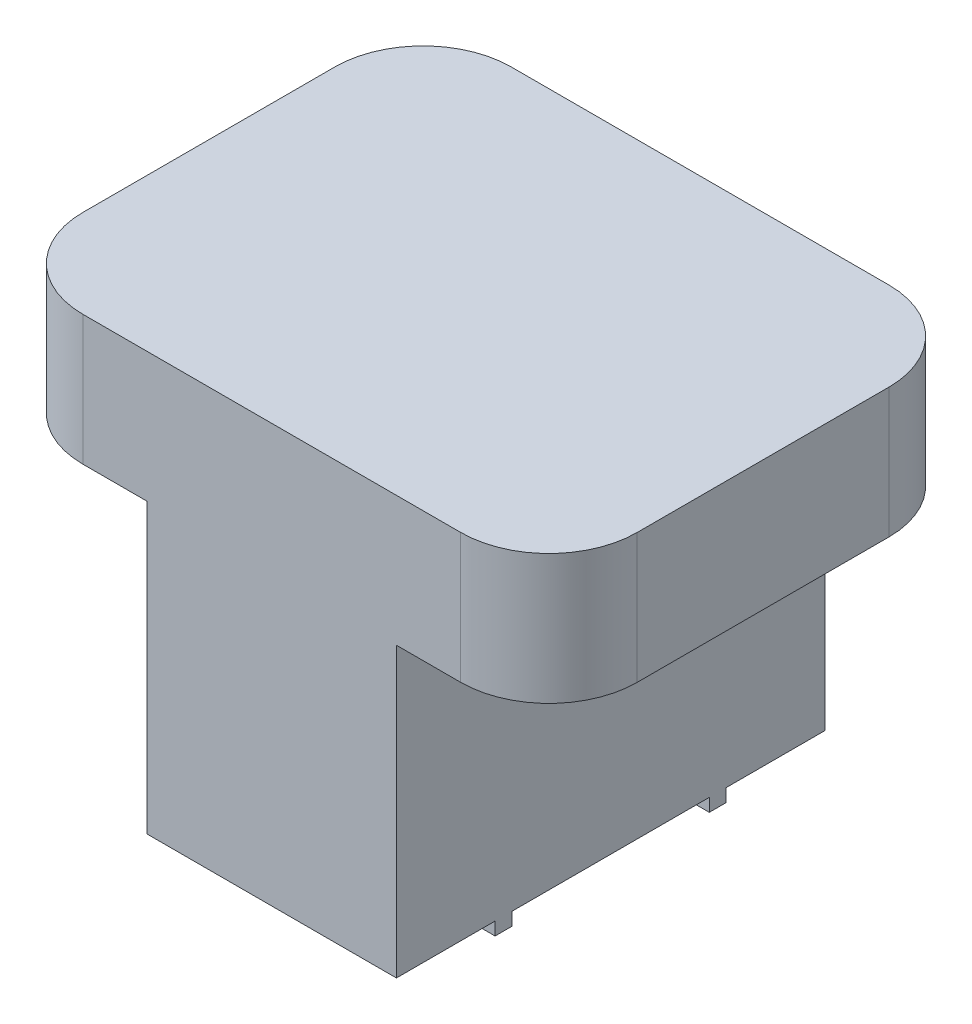
ISO-10303-21;
HEADER;
FILE_DESCRIPTION(('STEP AP214'),'2;1');
FILE_NAME('part.step','',(''),(''),'','','');
FILE_SCHEMA(('AUTOMOTIVE_DESIGN { 1 0 10303 214 1 1 1 1 }'));
ENDSEC;
DATA;
#1=APPLICATION_CONTEXT('core data for automotive mechanical design processes');
#2=APPLICATION_PROTOCOL_DEFINITION('international standard','automotive_design',2000,#1);
#3=PRODUCT_CONTEXT('',#1,'mechanical');
#4=PRODUCT('Part','Part','',(#3));
#5=PRODUCT_RELATED_PRODUCT_CATEGORY('part','',(#4));
#6=PRODUCT_DEFINITION_FORMATION('','',#4);
#7=PRODUCT_DEFINITION_CONTEXT('part definition',#1,'design');
#8=PRODUCT_DEFINITION('design','',#6,#7);
#9=PRODUCT_DEFINITION_SHAPE('','',#8);
#10=(LENGTH_UNIT() NAMED_UNIT(*) SI_UNIT(.MILLI.,.METRE.));
#11=(NAMED_UNIT(*) PLANE_ANGLE_UNIT() SI_UNIT($,.RADIAN.));
#12=(NAMED_UNIT(*) SI_UNIT($,.STERADIAN.) SOLID_ANGLE_UNIT());
#13=UNCERTAINTY_MEASURE_WITH_UNIT(LENGTH_MEASURE(1.E-05),#10,'distance_accuracy_value','');
#14=(GEOMETRIC_REPRESENTATION_CONTEXT(3) GLOBAL_UNCERTAINTY_ASSIGNED_CONTEXT((#13)) GLOBAL_UNIT_ASSIGNED_CONTEXT((#10,
#11,#12)) REPRESENTATION_CONTEXT('',''));
#15=CARTESIAN_POINT('',(0.,0.,0.));
#16=DIRECTION('',(0.,0.,1.));
#17=DIRECTION('',(1.,0.,0.));
#18=AXIS2_PLACEMENT_3D('',#15,#16,#17);
#19=CARTESIAN_POINT('',(18.4785,-20.447,-12.319));
#20=DIRECTION('',(0.,1.,0.));
#21=DIRECTION('',(0.,0.,1.));
#22=AXIS2_PLACEMENT_3D('',#19,#20,#21);
#23=PLANE('',#22);
#24=DIRECTION('',(-1.,0.,0.));
#25=VECTOR('',#24,1.);
#26=CARTESIAN_POINT('',(-6.70560000000001,-20.447,-9.652));
#27=LINE('',#26,#25);
#28=CARTESIAN_POINT('',(-6.70560000000001,-20.447,-9.652));
#29=VERTEX_POINT('',#28);
#30=CARTESIAN_POINT('',(-12.192,-20.447,-9.652));
#31=VERTEX_POINT('',#30);
#32=EDGE_CURVE('E57',#29,#31,#27,.T.);
#33=ORIENTED_EDGE('',*,*,#32,.F.);
#34=DIRECTION('',(0.,0.,-1.));
#35=VECTOR('',#34,1.);
#36=CARTESIAN_POINT('',(-6.70560000000001,-20.447,-9.652));
#37=LINE('',#36,#35);
#38=CARTESIAN_POINT('',(-6.70560000000001,-20.447,-11.303));
#39=VERTEX_POINT('',#38);
#40=EDGE_CURVE('E282',#29,#39,#37,.T.);
#41=ORIENTED_EDGE('',*,*,#40,.T.);
#42=DIRECTION('',(1.,0.,0.));
#43=VECTOR('',#42,1.);
#44=CARTESIAN_POINT('',(-12.192,-20.447,-11.303));
#45=LINE('',#44,#43);
#46=CARTESIAN_POINT('',(-12.192,-20.447,-11.303));
#47=VERTEX_POINT('',#46);
#48=EDGE_CURVE('E293',#47,#39,#45,.T.);
#49=ORIENTED_EDGE('',*,*,#48,.F.);
#50=DIRECTION('',(0.,0.,1.));
#51=VECTOR('',#50,1.);
#52=CARTESIAN_POINT('',(-12.192,-20.447,-20.955));
#53=LINE('',#52,#51);
#54=CARTESIAN_POINT('',(-12.192,-20.447,-20.955));
#55=VERTEX_POINT('',#54);
#56=EDGE_CURVE('E447',#55,#47,#53,.T.);
#57=ORIENTED_EDGE('',*,*,#56,.F.);
#58=DIRECTION('',(1.,0.,0.));
#59=VECTOR('',#58,1.);
#60=CARTESIAN_POINT('',(-18.4785,-20.447,-20.955));
#61=LINE('',#60,#59);
#62=CARTESIAN_POINT('',(12.192,-20.447,-20.955));
#63=VERTEX_POINT('',#62);
#64=EDGE_CURVE('E509',#55,#63,#61,.T.);
#65=ORIENTED_EDGE('',*,*,#64,.T.);
#66=DIRECTION('',(0.,0.,-1.));
#67=VECTOR('',#66,1.);
#68=CARTESIAN_POINT('',(12.192,-20.447,20.955));
#69=LINE('',#68,#67);
#70=CARTESIAN_POINT('',(12.192,-20.447,-11.303));
#71=VERTEX_POINT('',#70);
#72=EDGE_CURVE('E478',#71,#63,#69,.T.);
#73=ORIENTED_EDGE('',*,*,#72,.F.);
#74=DIRECTION('',(1.,0.,0.));
#75=VECTOR('',#74,1.);
#76=CARTESIAN_POINT('',(6.7056,-20.447,-11.303));
#77=LINE('',#76,#75);
#78=CARTESIAN_POINT('',(6.7056,-20.447,-11.303));
#79=VERTEX_POINT('',#78);
#80=EDGE_CURVE('E405',#79,#71,#77,.T.);
#81=ORIENTED_EDGE('',*,*,#80,.F.);
#82=DIRECTION('',(0.,0.,1.));
#83=VECTOR('',#82,1.);
#84=CARTESIAN_POINT('',(6.7056,-20.447,-11.303));
#85=LINE('',#84,#83);
#86=CARTESIAN_POINT('',(6.7056,-20.447,-9.652));
#87=VERTEX_POINT('',#86);
#88=EDGE_CURVE('E411',#79,#87,#85,.T.);
#89=ORIENTED_EDGE('',*,*,#88,.T.);
#90=DIRECTION('',(-1.,0.,0.));
#91=VECTOR('',#90,1.);
#92=CARTESIAN_POINT('',(12.192,-20.447,-9.652));
#93=LINE('',#92,#91);
#94=CARTESIAN_POINT('',(12.192,-20.447,-9.652));
#95=VERTEX_POINT('',#94);
#96=EDGE_CURVE('E406',#95,#87,#93,.T.);
#97=ORIENTED_EDGE('',*,*,#96,.F.);
#98=CARTESIAN_POINT('',(12.192,-20.447,9.652));
#99=VERTEX_POINT('',#98);
#100=EDGE_CURVE('E484',#99,#95,#69,.T.);
#101=ORIENTED_EDGE('',*,*,#100,.F.);
#102=DIRECTION('',(1.,0.,0.));
#103=VECTOR('',#102,1.);
#104=CARTESIAN_POINT('',(6.7056,-20.447,9.652));
#105=LINE('',#104,#103);
#106=CARTESIAN_POINT('',(6.7056,-20.447,9.652));
#107=VERTEX_POINT('',#106);
#108=EDGE_CURVE('E365',#107,#99,#105,.T.);
#109=ORIENTED_EDGE('',*,*,#108,.F.);
#110=DIRECTION('',(0.,0.,1.));
#111=VECTOR('',#110,1.);
#112=CARTESIAN_POINT('',(6.7056,-20.447,9.652));
#113=LINE('',#112,#111);
#114=CARTESIAN_POINT('',(6.7056,-20.447,11.303));
#115=VERTEX_POINT('',#114);
#116=EDGE_CURVE('E371',#107,#115,#113,.T.);
#117=ORIENTED_EDGE('',*,*,#116,.T.);
#118=DIRECTION('',(-1.,0.,0.));
#119=VECTOR('',#118,1.);
#120=CARTESIAN_POINT('',(12.192,-20.447,11.303));
#121=LINE('',#120,#119);
#122=CARTESIAN_POINT('',(12.192,-20.447,11.303));
#123=VERTEX_POINT('',#122);
#124=EDGE_CURVE('E366',#123,#115,#121,.T.);
#125=ORIENTED_EDGE('',*,*,#124,.F.);
#126=CARTESIAN_POINT('',(12.192,-20.447,20.955));
#127=VERTEX_POINT('',#126);
#128=EDGE_CURVE('E479',#127,#123,#69,.T.);
#129=ORIENTED_EDGE('',*,*,#128,.F.);
#130=DIRECTION('',(-1.,0.,0.));
#131=VECTOR('',#130,1.);
#132=CARTESIAN_POINT('',(18.4785,-20.447,20.955));
#133=LINE('',#132,#131);
#134=CARTESIAN_POINT('',(-12.192,-20.447,20.955));
#135=VERTEX_POINT('',#134);
#136=EDGE_CURVE('E510',#127,#135,#133,.T.);
#137=ORIENTED_EDGE('',*,*,#136,.T.);
#138=CARTESIAN_POINT('',(-12.192,-20.447,11.303));
#139=VERTEX_POINT('',#138);
#140=EDGE_CURVE('E446',#139,#135,#53,.T.);
#141=ORIENTED_EDGE('',*,*,#140,.F.);
#142=DIRECTION('',(-1.,0.,0.));
#143=VECTOR('',#142,1.);
#144=CARTESIAN_POINT('',(-6.7056,-20.447,11.303));
#145=LINE('',#144,#143);
#146=CARTESIAN_POINT('',(-6.7056,-20.447,11.303));
#147=VERTEX_POINT('',#146);
#148=EDGE_CURVE('E68',#147,#139,#145,.T.);
#149=ORIENTED_EDGE('',*,*,#148,.F.);
#150=DIRECTION('',(0.,0.,-1.));
#151=VECTOR('',#150,1.);
#152=CARTESIAN_POINT('',(-6.7056,-20.447,11.303));
#153=LINE('',#152,#151);
#154=CARTESIAN_POINT('',(-6.7056,-20.447,9.652));
#155=VERTEX_POINT('',#154);
#156=EDGE_CURVE('E326',#147,#155,#153,.T.);
#157=ORIENTED_EDGE('',*,*,#156,.T.);
#158=DIRECTION('',(1.,0.,0.));
#159=VECTOR('',#158,1.);
#160=CARTESIAN_POINT('',(-12.192,-20.447,9.652));
#161=LINE('',#160,#159);
#162=CARTESIAN_POINT('',(-12.192,-20.447,9.652));
#163=VERTEX_POINT('',#162);
#164=EDGE_CURVE('E330',#163,#155,#161,.T.);
#165=ORIENTED_EDGE('',*,*,#164,.F.);
#166=EDGE_CURVE('E451',#31,#163,#53,.T.);
#167=ORIENTED_EDGE('',*,*,#166,.F.);
#168=EDGE_LOOP('',(#33,#41,#49,#57,#65,#73,#81,#89,#97,#101,#109,#117,#125,#129,#137,#141,#149,
#157,#165,#167));
#169=FACE_BOUND('',#168,.T.);
#170=ADVANCED_FACE('F38',(#169),#23,.F.);
#171=CARTESIAN_POINT('',(18.4785,20.447,-12.319));
#172=DIRECTION('',(0.,-1.,0.));
#173=DIRECTION('',(0.,0.,-1.));
#174=AXIS2_PLACEMENT_3D('',#171,#172,#173);
#175=CYLINDRICAL_SURFACE('',#174,8.636);
#176=DIRECTION('',(0.,-1.,0.));
#177=VECTOR('',#176,1.);
#178=CARTESIAN_POINT('',(27.1145,20.447,-12.319));
#179=LINE('',#178,#177);
#180=CARTESIAN_POINT('',(27.1145,20.447,-12.319));
#181=VERTEX_POINT('',#180);
#182=CARTESIAN_POINT('',(27.1145,7.747,-12.319));
#183=VERTEX_POINT('',#182);
#184=EDGE_CURVE('E522',#181,#183,#179,.T.);
#185=ORIENTED_EDGE('',*,*,#184,.T.);
#186=CARTESIAN_POINT('',(18.4785,7.747,-12.319));
#187=DIRECTION('',(0.,1.,0.));
#188=DIRECTION('',(0.,0.,1.));
#189=AXIS2_PLACEMENT_3D('',#186,#187,#188);
#190=CIRCLE('',#189,8.636);
#191=CARTESIAN_POINT('',(18.4785,7.747,-20.955));
#192=VERTEX_POINT('',#191);
#193=EDGE_CURVE('E500',#192,#183,#190,.F.);
#194=ORIENTED_EDGE('',*,*,#193,.F.);
#195=DIRECTION('',(0.,-1.,0.));
#196=VECTOR('',#195,1.);
#197=CARTESIAN_POINT('',(18.4785,20.447,-20.955));
#198=LINE('',#197,#196);
#199=CARTESIAN_POINT('',(18.4785,20.447,-20.955));
#200=VERTEX_POINT('',#199);
#201=EDGE_CURVE('E11',#200,#192,#198,.T.);
#202=ORIENTED_EDGE('',*,*,#201,.F.);
#203=CARTESIAN_POINT('',(18.4785,20.447,-12.319));
#204=DIRECTION('',(0.,1.,0.));
#205=DIRECTION('',(0.,0.,1.));
#206=AXIS2_PLACEMENT_3D('',#203,#204,#205);
#207=CIRCLE('',#206,8.636);
#208=EDGE_CURVE('E514',#181,#200,#207,.T.);
#209=ORIENTED_EDGE('',*,*,#208,.F.);
#210=EDGE_LOOP('',(#185,#194,#202,#209));
#211=FACE_BOUND('',#210,.T.);
#212=ADVANCED_FACE('F589',(#211),#175,.T.);
#213=CARTESIAN_POINT('',(-18.4785,20.447,-20.955));
#214=DIRECTION('',(0.,0.,-1.));
#215=DIRECTION('',(-1.,0.,0.));
#216=AXIS2_PLACEMENT_3D('',#213,#214,#215);
#217=PLANE('',#216);
#218=DIRECTION('',(1.,0.,0.));
#219=VECTOR('',#218,1.);
#220=CARTESIAN_POINT('',(-18.4785,7.747,-20.955));
#221=LINE('',#220,#219);
#222=CARTESIAN_POINT('',(-18.4785,7.747,-20.955));
#223=VERTEX_POINT('',#222);
#224=CARTESIAN_POINT('',(-12.192,7.747,-20.955));
#225=VERTEX_POINT('',#224);
#226=EDGE_CURVE('E456',#223,#225,#221,.T.);
#227=ORIENTED_EDGE('',*,*,#226,.F.);
#228=DIRECTION('',(0.,-1.,0.));
#229=VECTOR('',#228,1.);
#230=CARTESIAN_POINT('',(-18.4785,20.447,-20.955));
#231=LINE('',#230,#229);
#232=CARTESIAN_POINT('',(-18.4785,20.447,-20.955));
#233=VERTEX_POINT('',#232);
#234=EDGE_CURVE('E47',#233,#223,#231,.T.);
#235=ORIENTED_EDGE('',*,*,#234,.F.);
#236=DIRECTION('',(1.,0.,0.));
#237=VECTOR('',#236,1.);
#238=CARTESIAN_POINT('',(-18.4785,20.447,-20.955));
#239=LINE('',#238,#237);
#240=EDGE_CURVE('E543',#233,#200,#239,.T.);
#241=ORIENTED_EDGE('',*,*,#240,.T.);
#242=ORIENTED_EDGE('',*,*,#201,.T.);
#243=DIRECTION('',(1.,0.,0.));
#244=VECTOR('',#243,1.);
#245=CARTESIAN_POINT('',(12.192,7.747,-20.955));
#246=LINE('',#245,#244);
#247=CARTESIAN_POINT('',(12.192,7.74700000000002,-20.955));
#248=VERTEX_POINT('',#247);
#249=EDGE_CURVE('E502',#248,#192,#246,.T.);
#250=ORIENTED_EDGE('',*,*,#249,.F.);
#251=DIRECTION('',(0.,-1.,0.));
#252=VECTOR('',#251,1.);
#253=CARTESIAN_POINT('',(12.192,64.9344039054877,-20.955));
#254=LINE('',#253,#252);
#255=EDGE_CURVE('E488',#248,#63,#254,.T.);
#256=ORIENTED_EDGE('',*,*,#255,.T.);
#257=ORIENTED_EDGE('',*,*,#64,.F.);
#258=DIRECTION('',(0.,-1.,0.));
#259=VECTOR('',#258,1.);
#260=CARTESIAN_POINT('',(-12.192,64.9344039054877,-20.955));
#261=LINE('',#260,#259);
#262=EDGE_CURVE('E460',#225,#55,#261,.T.);
#263=ORIENTED_EDGE('',*,*,#262,.F.);
#264=EDGE_LOOP('',(#227,#235,#241,#242,#250,#256,#257,#263));
#265=FACE_BOUND('',#264,.T.);
#266=ADVANCED_FACE('F40',(#265),#217,.T.);
#267=CARTESIAN_POINT('',(-18.4785,20.447,-12.319));
#268=DIRECTION('',(0.,-1.,0.));
#269=DIRECTION('',(0.,0.,-1.));
#270=AXIS2_PLACEMENT_3D('',#267,#268,#269);
#271=CYLINDRICAL_SURFACE('',#270,8.636);
#272=CARTESIAN_POINT('',(-18.4785,7.747,-12.319));
#273=DIRECTION('',(0.,1.,0.));
#274=DIRECTION('',(0.,0.,1.));
#275=AXIS2_PLACEMENT_3D('',#272,#273,#274);
#276=CIRCLE('',#275,8.636);
#277=CARTESIAN_POINT('',(-27.1145,7.747,-12.319));
#278=VERTEX_POINT('',#277);
#279=EDGE_CURVE('E461',#278,#223,#276,.F.);
#280=ORIENTED_EDGE('',*,*,#279,.F.);
#281=DIRECTION('',(0.,-1.,0.));
#282=VECTOR('',#281,1.);
#283=CARTESIAN_POINT('',(-27.1145,20.447,-12.319));
#284=LINE('',#283,#282);
#285=CARTESIAN_POINT('',(-27.1145,20.447,-12.319));
#286=VERTEX_POINT('',#285);
#287=EDGE_CURVE('E569',#286,#278,#284,.T.);
#288=ORIENTED_EDGE('',*,*,#287,.F.);
#289=CARTESIAN_POINT('',(-18.4785,20.447,-12.319));
#290=DIRECTION('',(0.,-1.,0.));
#291=DIRECTION('',(0.,0.,-1.));
#292=AXIS2_PLACEMENT_3D('',#289,#290,#291);
#293=CIRCLE('',#292,8.636);
#294=EDGE_CURVE('E539',#286,#233,#293,.T.);
#295=ORIENTED_EDGE('',*,*,#294,.T.);
#296=ORIENTED_EDGE('',*,*,#234,.T.);
#297=EDGE_LOOP('',(#280,#288,#295,#296));
#298=FACE_BOUND('',#297,.T.);
#299=ADVANCED_FACE('F576',(#298),#271,.T.);
#300=CARTESIAN_POINT('',(-27.1145,20.447,-12.319));
#301=DIRECTION('',(1.,0.,0.));
#302=DIRECTION('',(0.,0.,-1.));
#303=AXIS2_PLACEMENT_3D('',#300,#301,#302);
#304=PLANE('',#303);
#305=ORIENTED_EDGE('',*,*,#287,.T.);
#306=DIRECTION('',(0.,0.,-1.));
#307=VECTOR('',#306,1.);
#308=CARTESIAN_POINT('',(-27.1145,7.747,12.319));
#309=LINE('',#308,#307);
#310=CARTESIAN_POINT('',(-27.1145,7.747,12.319));
#311=VERTEX_POINT('',#310);
#312=EDGE_CURVE('E464',#311,#278,#309,.T.);
#313=ORIENTED_EDGE('',*,*,#312,.F.);
#314=DIRECTION('',(0.,-1.,0.));
#315=VECTOR('',#314,1.);
#316=CARTESIAN_POINT('',(-27.1145,20.447,12.319));
#317=LINE('',#316,#315);
#318=CARTESIAN_POINT('',(-27.1145,20.447,12.319));
#319=VERTEX_POINT('',#318);
#320=EDGE_CURVE('E565',#319,#311,#317,.T.);
#321=ORIENTED_EDGE('',*,*,#320,.F.);
#322=DIRECTION('',(0.,0.,1.));
#323=VECTOR('',#322,1.);
#324=CARTESIAN_POINT('',(-27.1145,20.447,-12.319));
#325=LINE('',#324,#323);
#326=EDGE_CURVE('E535',#286,#319,#325,.T.);
#327=ORIENTED_EDGE('',*,*,#326,.F.);
#328=EDGE_LOOP('',(#305,#313,#321,#327));
#329=FACE_BOUND('',#328,.T.);
#330=ADVANCED_FACE('F612',(#329),#304,.F.);
#331=CARTESIAN_POINT('',(-18.4785,20.447,12.319));
#332=DIRECTION('',(0.,-1.,0.));
#333=DIRECTION('',(0.,0.,-1.));
#334=AXIS2_PLACEMENT_3D('',#331,#332,#333);
#335=CYLINDRICAL_SURFACE('',#334,8.636);
#336=ORIENTED_EDGE('',*,*,#320,.T.);
#337=CARTESIAN_POINT('',(-18.4785,7.747,12.319));
#338=DIRECTION('',(0.,1.,0.));
#339=DIRECTION('',(0.,0.,1.));
#340=AXIS2_PLACEMENT_3D('',#337,#338,#339);
#341=CIRCLE('',#340,8.636);
#342=CARTESIAN_POINT('',(-18.4785,7.747,20.955));
#343=VERTEX_POINT('',#342);
#344=EDGE_CURVE('E467',#343,#311,#341,.F.);
#345=ORIENTED_EDGE('',*,*,#344,.F.);
#346=DIRECTION('',(0.,-1.,0.));
#347=VECTOR('',#346,1.);
#348=CARTESIAN_POINT('',(-18.4785,20.447,20.955));
#349=LINE('',#348,#347);
#350=CARTESIAN_POINT('',(-18.4785,20.447,20.955));
#351=VERTEX_POINT('',#350);
#352=EDGE_CURVE('E561',#351,#343,#349,.T.);
#353=ORIENTED_EDGE('',*,*,#352,.F.);
#354=CARTESIAN_POINT('',(-18.4785,20.447,12.319));
#355=DIRECTION('',(0.,1.,0.));
#356=DIRECTION('',(0.,0.,1.));
#357=AXIS2_PLACEMENT_3D('',#354,#355,#356);
#358=CIRCLE('',#357,8.636);
#359=EDGE_CURVE('E531',#319,#351,#358,.T.);
#360=ORIENTED_EDGE('',*,*,#359,.F.);
#361=EDGE_LOOP('',(#336,#345,#353,#360));
#362=FACE_BOUND('',#361,.T.);
#363=ADVANCED_FACE('F615',(#362),#335,.T.);
#364=CARTESIAN_POINT('',(18.4785,20.447,20.955));
#365=DIRECTION('',(0.,0.,1.));
#366=DIRECTION('',(1.,0.,0.));
#367=AXIS2_PLACEMENT_3D('',#364,#365,#366);
#368=PLANE('',#367);
#369=DIRECTION('',(-1.,0.,0.));
#370=VECTOR('',#369,1.);
#371=CARTESIAN_POINT('',(-12.192,7.747,20.955));
#372=LINE('',#371,#370);
#373=CARTESIAN_POINT('',(-12.192,7.74700000000002,20.955));
#374=VERTEX_POINT('',#373);
#375=EDGE_CURVE('E470',#374,#343,#372,.T.);
#376=ORIENTED_EDGE('',*,*,#375,.F.);
#377=DIRECTION('',(0.,-1.,0.));
#378=VECTOR('',#377,1.);
#379=CARTESIAN_POINT('',(-12.192,64.9344039054877,20.955));
#380=LINE('',#379,#378);
#381=EDGE_CURVE('E455',#374,#135,#380,.T.);
#382=ORIENTED_EDGE('',*,*,#381,.T.);
#383=ORIENTED_EDGE('',*,*,#136,.F.);
#384=DIRECTION('',(0.,-1.,0.));
#385=VECTOR('',#384,1.);
#386=CARTESIAN_POINT('',(12.192,64.9344039054877,20.955));
#387=LINE('',#386,#385);
#388=CARTESIAN_POINT('',(12.192,7.747,20.955));
#389=VERTEX_POINT('',#388);
#390=EDGE_CURVE('E493',#389,#127,#387,.T.);
#391=ORIENTED_EDGE('',*,*,#390,.F.);
#392=DIRECTION('',(-1.,0.,0.));
#393=VECTOR('',#392,1.);
#394=CARTESIAN_POINT('',(18.4785,7.747,20.955));
#395=LINE('',#394,#393);
#396=CARTESIAN_POINT('',(18.4785,7.747,20.955));
#397=VERTEX_POINT('',#396);
#398=EDGE_CURVE('E489',#397,#389,#395,.T.);
#399=ORIENTED_EDGE('',*,*,#398,.F.);
#400=DIRECTION('',(0.,-1.,0.));
#401=VECTOR('',#400,1.);
#402=CARTESIAN_POINT('',(18.4785,20.447,20.955));
#403=LINE('',#402,#401);
#404=CARTESIAN_POINT('',(18.4785,20.447,20.955));
#405=VERTEX_POINT('',#404);
#406=EDGE_CURVE('E557',#405,#397,#403,.T.);
#407=ORIENTED_EDGE('',*,*,#406,.F.);
#408=DIRECTION('',(-1.,0.,0.));
#409=VECTOR('',#408,1.);
#410=CARTESIAN_POINT('',(18.4785,20.447,20.955));
#411=LINE('',#410,#409);
#412=EDGE_CURVE('E527',#405,#351,#411,.T.);
#413=ORIENTED_EDGE('',*,*,#412,.T.);
#414=ORIENTED_EDGE('',*,*,#352,.T.);
#415=EDGE_LOOP('',(#376,#382,#383,#391,#399,#407,#413,#414));
#416=FACE_BOUND('',#415,.T.);
#417=ADVANCED_FACE('F618',(#416),#368,.T.);
#418=CARTESIAN_POINT('',(18.4785,20.447,12.319));
#419=DIRECTION('',(0.,-1.,0.));
#420=DIRECTION('',(0.,0.,-1.));
#421=AXIS2_PLACEMENT_3D('',#418,#419,#420);
#422=CYLINDRICAL_SURFACE('',#421,8.636);
#423=CARTESIAN_POINT('',(18.4785,7.747,12.319));
#424=DIRECTION('',(0.,1.,0.));
#425=DIRECTION('',(0.,0.,1.));
#426=AXIS2_PLACEMENT_3D('',#423,#424,#425);
#427=CIRCLE('',#426,8.636);
#428=CARTESIAN_POINT('',(27.1145,7.747,12.319));
#429=VERTEX_POINT('',#428);
#430=EDGE_CURVE('E494',#429,#397,#427,.F.);
#431=ORIENTED_EDGE('',*,*,#430,.F.);
#432=DIRECTION('',(0.,-1.,0.));
#433=VECTOR('',#432,1.);
#434=CARTESIAN_POINT('',(27.1145,20.447,12.319));
#435=LINE('',#434,#433);
#436=CARTESIAN_POINT('',(27.1145,20.447,12.319));
#437=VERTEX_POINT('',#436);
#438=EDGE_CURVE('E553',#437,#429,#435,.T.);
#439=ORIENTED_EDGE('',*,*,#438,.F.);
#440=CARTESIAN_POINT('',(18.4785,20.447,12.319));
#441=DIRECTION('',(0.,-1.,0.));
#442=DIRECTION('',(0.,0.,-1.));
#443=AXIS2_PLACEMENT_3D('',#440,#441,#442);
#444=CIRCLE('',#443,8.636);
#445=EDGE_CURVE('E523',#437,#405,#444,.T.);
#446=ORIENTED_EDGE('',*,*,#445,.T.);
#447=ORIENTED_EDGE('',*,*,#406,.T.);
#448=EDGE_LOOP('',(#431,#439,#446,#447));
#449=FACE_BOUND('',#448,.T.);
#450=ADVANCED_FACE('F621',(#449),#422,.T.);
#451=CARTESIAN_POINT('',(27.1145,20.447,12.319));
#452=DIRECTION('',(-1.,0.,0.));
#453=DIRECTION('',(0.,0.,1.));
#454=AXIS2_PLACEMENT_3D('',#451,#452,#453);
#455=PLANE('',#454);
#456=ORIENTED_EDGE('',*,*,#438,.T.);
#457=DIRECTION('',(0.,0.,1.));
#458=VECTOR('',#457,1.);
#459=CARTESIAN_POINT('',(27.1145,7.747,-12.319));
#460=LINE('',#459,#458);
#461=EDGE_CURVE('E497',#183,#429,#460,.T.);
#462=ORIENTED_EDGE('',*,*,#461,.F.);
#463=ORIENTED_EDGE('',*,*,#184,.F.);
#464=DIRECTION('',(0.,0.,-1.));
#465=VECTOR('',#464,1.);
#466=CARTESIAN_POINT('',(27.1145,20.447,12.319));
#467=LINE('',#466,#465);
#468=EDGE_CURVE('E518',#437,#181,#467,.T.);
#469=ORIENTED_EDGE('',*,*,#468,.F.);
#470=EDGE_LOOP('',(#456,#462,#463,#469));
#471=FACE_BOUND('',#470,.T.);
#472=ADVANCED_FACE('F623',(#471),#455,.F.);
#473=CARTESIAN_POINT('',(18.4785,20.447,-12.319));
#474=DIRECTION('',(0.,1.,0.));
#475=DIRECTION('',(0.,0.,1.));
#476=AXIS2_PLACEMENT_3D('',#473,#474,#475);
#477=PLANE('',#476);
#478=ORIENTED_EDGE('',*,*,#208,.T.);
#479=ORIENTED_EDGE('',*,*,#240,.F.);
#480=ORIENTED_EDGE('',*,*,#294,.F.);
#481=ORIENTED_EDGE('',*,*,#326,.T.);
#482=ORIENTED_EDGE('',*,*,#359,.T.);
#483=ORIENTED_EDGE('',*,*,#412,.F.);
#484=ORIENTED_EDGE('',*,*,#445,.F.);
#485=ORIENTED_EDGE('',*,*,#468,.T.);
#486=EDGE_LOOP('',(#478,#479,#480,#481,#482,#483,#484,#485));
#487=FACE_BOUND('',#486,.T.);
#488=ADVANCED_FACE('F583',(#487),#477,.T.);
#489=CARTESIAN_POINT('',(18.4785,7.747,-12.319));
#490=DIRECTION('',(0.,1.,0.));
#491=DIRECTION('',(0.,0.,1.));
#492=AXIS2_PLACEMENT_3D('',#489,#490,#491);
#493=PLANE('',#492);
#494=ORIENTED_EDGE('',*,*,#398,.T.);
#495=DIRECTION('',(0.,0.,-1.));
#496=VECTOR('',#495,1.);
#497=CARTESIAN_POINT('',(12.192,7.747,20.955));
#498=LINE('',#497,#496);
#499=EDGE_CURVE('E483',#389,#248,#498,.T.);
#500=ORIENTED_EDGE('',*,*,#499,.T.);
#501=ORIENTED_EDGE('',*,*,#249,.T.);
#502=ORIENTED_EDGE('',*,*,#193,.T.);
#503=ORIENTED_EDGE('',*,*,#461,.T.);
#504=ORIENTED_EDGE('',*,*,#430,.T.);
#505=EDGE_LOOP('',(#494,#500,#501,#502,#503,#504));
#506=FACE_BOUND('',#505,.T.);
#507=ADVANCED_FACE('F594',(#506),#493,.F.);
#508=CARTESIAN_POINT('',(12.192,64.9344039054877,20.955));
#509=DIRECTION('',(-1.,0.,0.));
#510=DIRECTION('',(0.,0.,1.));
#511=AXIS2_PLACEMENT_3D('',#508,#509,#510);
#512=PLANE('',#511);
#513=ORIENTED_EDGE('',*,*,#390,.T.);
#514=ORIENTED_EDGE('',*,*,#128,.T.);
#515=DIRECTION('',(0.,1.,0.));
#516=VECTOR('',#515,1.);
#517=CARTESIAN_POINT('',(12.192,-21.717,11.303));
#518=LINE('',#517,#516);
#519=CARTESIAN_POINT('',(12.192,-21.717,11.303));
#520=VERTEX_POINT('',#519);
#521=EDGE_CURVE('E402',#520,#123,#518,.T.);
#522=ORIENTED_EDGE('',*,*,#521,.F.);
#523=DIRECTION('',(0.,0.,-1.));
#524=VECTOR('',#523,1.);
#525=CARTESIAN_POINT('',(12.192,-21.717,11.303));
#526=LINE('',#525,#524);
#527=CARTESIAN_POINT('',(12.192,-21.717,9.65200000000001));
#528=VERTEX_POINT('',#527);
#529=EDGE_CURVE('E370',#520,#528,#526,.T.);
#530=ORIENTED_EDGE('',*,*,#529,.T.);
#531=DIRECTION('',(0.,1.,0.));
#532=VECTOR('',#531,1.);
#533=CARTESIAN_POINT('',(12.192,-21.717,9.65200000000001));
#534=LINE('',#533,#532);
#535=EDGE_CURVE('E381',#528,#99,#534,.T.);
#536=ORIENTED_EDGE('',*,*,#535,.T.);
#537=ORIENTED_EDGE('',*,*,#100,.T.);
#538=DIRECTION('',(0.,1.,0.));
#539=VECTOR('',#538,1.);
#540=CARTESIAN_POINT('',(12.192,-21.717,-9.652));
#541=LINE('',#540,#539);
#542=CARTESIAN_POINT('',(12.192,-21.717,-9.652));
#543=VERTEX_POINT('',#542);
#544=EDGE_CURVE('E442',#543,#95,#541,.T.);
#545=ORIENTED_EDGE('',*,*,#544,.F.);
#546=DIRECTION('',(0.,0.,-1.));
#547=VECTOR('',#546,1.);
#548=CARTESIAN_POINT('',(12.192,-21.717,-9.652));
#549=LINE('',#548,#547);
#550=CARTESIAN_POINT('',(12.192,-21.717,-11.303));
#551=VERTEX_POINT('',#550);
#552=EDGE_CURVE('E410',#543,#551,#549,.T.);
#553=ORIENTED_EDGE('',*,*,#552,.T.);
#554=DIRECTION('',(0.,1.,0.));
#555=VECTOR('',#554,1.);
#556=CARTESIAN_POINT('',(12.192,-21.717,-11.303));
#557=LINE('',#556,#555);
#558=EDGE_CURVE('E421',#551,#71,#557,.T.);
#559=ORIENTED_EDGE('',*,*,#558,.T.);
#560=ORIENTED_EDGE('',*,*,#72,.T.);
#561=ORIENTED_EDGE('',*,*,#255,.F.);
#562=ORIENTED_EDGE('',*,*,#499,.F.);
#563=EDGE_LOOP('',(#513,#514,#522,#530,#536,#537,#545,#553,#559,#560,#561,#562));
#564=FACE_BOUND('',#563,.T.);
#565=ADVANCED_FACE('F599',(#564),#512,.F.);
#566=CARTESIAN_POINT('',(18.4785,7.747,-12.319));
#567=DIRECTION('',(0.,1.,0.));
#568=DIRECTION('',(0.,0.,1.));
#569=AXIS2_PLACEMENT_3D('',#566,#567,#568);
#570=PLANE('',#569);
#571=ORIENTED_EDGE('',*,*,#226,.T.);
#572=DIRECTION('',(0.,0.,1.));
#573=VECTOR('',#572,1.);
#574=CARTESIAN_POINT('',(-12.192,7.747,-20.955));
#575=LINE('',#574,#573);
#576=EDGE_CURVE('E450',#225,#374,#575,.T.);
#577=ORIENTED_EDGE('',*,*,#576,.T.);
#578=ORIENTED_EDGE('',*,*,#375,.T.);
#579=ORIENTED_EDGE('',*,*,#344,.T.);
#580=ORIENTED_EDGE('',*,*,#312,.T.);
#581=ORIENTED_EDGE('',*,*,#279,.T.);
#582=EDGE_LOOP('',(#571,#577,#578,#579,#580,#581));
#583=FACE_BOUND('',#582,.T.);
#584=ADVANCED_FACE('F608',(#583),#570,.F.);
#585=CARTESIAN_POINT('',(-12.192,64.9344039054877,-20.955));
#586=DIRECTION('',(1.,0.,0.));
#587=DIRECTION('',(0.,0.,-1.));
#588=AXIS2_PLACEMENT_3D('',#585,#586,#587);
#589=PLANE('',#588);
#590=ORIENTED_EDGE('',*,*,#262,.T.);
#591=ORIENTED_EDGE('',*,*,#56,.T.);
#592=DIRECTION('',(0.,1.,0.));
#593=VECTOR('',#592,1.);
#594=CARTESIAN_POINT('',(-12.192,-21.717,-11.303));
#595=LINE('',#594,#593);
#596=CARTESIAN_POINT('',(-12.192,-21.717,-11.303));
#597=VERTEX_POINT('',#596);
#598=EDGE_CURVE('E289',#597,#47,#595,.T.);
#599=ORIENTED_EDGE('',*,*,#598,.F.);
#600=DIRECTION('',(0.,0.,1.));
#601=VECTOR('',#600,1.);
#602=CARTESIAN_POINT('',(-12.192,-21.717,-11.303));
#603=LINE('',#602,#601);
#604=CARTESIAN_POINT('',(-12.192,-21.717,-9.652));
#605=VERTEX_POINT('',#604);
#606=EDGE_CURVE('E309',#597,#605,#603,.T.);
#607=ORIENTED_EDGE('',*,*,#606,.T.);
#608=DIRECTION('',(0.,1.,0.));
#609=VECTOR('',#608,1.);
#610=CARTESIAN_POINT('',(-12.192,-21.717,-9.652));
#611=LINE('',#610,#609);
#612=EDGE_CURVE('E320',#605,#31,#611,.T.);
#613=ORIENTED_EDGE('',*,*,#612,.T.);
#614=ORIENTED_EDGE('',*,*,#166,.T.);
#615=DIRECTION('',(0.,1.,0.));
#616=VECTOR('',#615,1.);
#617=CARTESIAN_POINT('',(-12.192,-21.717,9.652));
#618=LINE('',#617,#616);
#619=CARTESIAN_POINT('',(-12.192,-21.717,9.652));
#620=VERTEX_POINT('',#619);
#621=EDGE_CURVE('E355',#620,#163,#618,.T.);
#622=ORIENTED_EDGE('',*,*,#621,.F.);
#623=DIRECTION('',(0.,0.,1.));
#624=VECTOR('',#623,1.);
#625=CARTESIAN_POINT('',(-12.192,-21.717,9.652));
#626=LINE('',#625,#624);
#627=CARTESIAN_POINT('',(-12.192,-21.717,11.303));
#628=VERTEX_POINT('',#627);
#629=EDGE_CURVE('E342',#620,#628,#626,.T.);
#630=ORIENTED_EDGE('',*,*,#629,.T.);
#631=DIRECTION('',(0.,1.,0.));
#632=VECTOR('',#631,1.);
#633=CARTESIAN_POINT('',(-12.192,-21.717,11.303));
#634=LINE('',#633,#632);
#635=EDGE_CURVE('E359',#628,#139,#634,.T.);
#636=ORIENTED_EDGE('',*,*,#635,.T.);
#637=ORIENTED_EDGE('',*,*,#140,.T.);
#638=ORIENTED_EDGE('',*,*,#381,.F.);
#639=ORIENTED_EDGE('',*,*,#576,.F.);
#640=EDGE_LOOP('',(#590,#591,#599,#607,#613,#614,#622,#630,#636,#637,#638,#639));
#641=FACE_BOUND('',#640,.T.);
#642=ADVANCED_FACE('F605',(#641),#589,.F.);
#643=CARTESIAN_POINT('',(12.192,-21.717,-9.652));
#644=DIRECTION('',(0.,0.,-1.));
#645=DIRECTION('',(-1.,0.,0.));
#646=AXIS2_PLACEMENT_3D('',#643,#644,#645);
#647=PLANE('',#646);
#648=DIRECTION('',(0.,1.,0.));
#649=VECTOR('',#648,1.);
#650=CARTESIAN_POINT('',(6.7056,-21.717,-9.652));
#651=LINE('',#650,#649);
#652=CARTESIAN_POINT('',(6.7056,-21.717,-9.652));
#653=VERTEX_POINT('',#652);
#654=EDGE_CURVE('E439',#653,#87,#651,.T.);
#655=ORIENTED_EDGE('',*,*,#654,.F.);
#656=DIRECTION('',(-1.,0.,0.));
#657=VECTOR('',#656,1.);
#658=CARTESIAN_POINT('',(12.192,-21.717,-9.652));
#659=LINE('',#658,#657);
#660=EDGE_CURVE('E417',#543,#653,#659,.T.);
#661=ORIENTED_EDGE('',*,*,#660,.F.);
#662=ORIENTED_EDGE('',*,*,#544,.T.);
#663=ORIENTED_EDGE('',*,*,#96,.T.);
#664=EDGE_LOOP('',(#655,#661,#662,#663));
#665=FACE_BOUND('',#664,.T.);
#666=ADVANCED_FACE('F647',(#665),#647,.F.);
#667=CARTESIAN_POINT('',(6.7056,-21.717,-11.303));
#668=DIRECTION('',(-1.,0.,0.));
#669=DIRECTION('',(0.,0.,1.));
#670=AXIS2_PLACEMENT_3D('',#667,#668,#669);
#671=PLANE('',#670);
#672=DIRECTION('',(0.,1.,0.));
#673=VECTOR('',#672,1.);
#674=CARTESIAN_POINT('',(6.7056,-21.717,-11.303));
#675=LINE('',#674,#673);
#676=CARTESIAN_POINT('',(6.7056,-21.717,-11.303));
#677=VERTEX_POINT('',#676);
#678=EDGE_CURVE('E436',#677,#79,#675,.T.);
#679=ORIENTED_EDGE('',*,*,#678,.F.);
#680=DIRECTION('',(0.,0.,1.));
#681=VECTOR('',#680,1.);
#682=CARTESIAN_POINT('',(6.7056,-21.717,-11.303));
#683=LINE('',#682,#681);
#684=EDGE_CURVE('E422',#677,#653,#683,.T.);
#685=ORIENTED_EDGE('',*,*,#684,.T.);
#686=ORIENTED_EDGE('',*,*,#654,.T.);
#687=ORIENTED_EDGE('',*,*,#88,.F.);
#688=EDGE_LOOP('',(#679,#685,#686,#687));
#689=FACE_BOUND('',#688,.T.);
#690=ADVANCED_FACE('F650',(#689),#671,.T.);
#691=CARTESIAN_POINT('',(6.7056,-21.717,-11.303));
#692=DIRECTION('',(0.,0.,1.));
#693=DIRECTION('',(1.,0.,0.));
#694=AXIS2_PLACEMENT_3D('',#691,#692,#693);
#695=PLANE('',#694);
#696=DIRECTION('',(1.,0.,0.));
#697=VECTOR('',#696,1.);
#698=CARTESIAN_POINT('',(6.7056,-21.717,-11.303));
#699=LINE('',#698,#697);
#700=EDGE_CURVE('E426',#677,#551,#699,.T.);
#701=ORIENTED_EDGE('',*,*,#700,.F.);
#702=ORIENTED_EDGE('',*,*,#678,.T.);
#703=ORIENTED_EDGE('',*,*,#80,.T.);
#704=ORIENTED_EDGE('',*,*,#558,.F.);
#705=EDGE_LOOP('',(#701,#702,#703,#704));
#706=FACE_BOUND('',#705,.T.);
#707=ADVANCED_FACE('F654',(#706),#695,.F.);
#708=CARTESIAN_POINT('',(12.192,-21.717,-11.303));
#709=DIRECTION('',(0.,-1.,0.));
#710=DIRECTION('',(0.,0.,-1.));
#711=AXIS2_PLACEMENT_3D('',#708,#709,#710);
#712=PLANE('',#711);
#713=ORIENTED_EDGE('',*,*,#552,.F.);
#714=ORIENTED_EDGE('',*,*,#660,.T.);
#715=ORIENTED_EDGE('',*,*,#684,.F.);
#716=ORIENTED_EDGE('',*,*,#700,.T.);
#717=EDGE_LOOP('',(#713,#714,#715,#716));
#718=FACE_BOUND('',#717,.T.);
#719=ADVANCED_FACE('F656',(#718),#712,.T.);
#720=CARTESIAN_POINT('',(12.192,-21.717,11.303));
#721=DIRECTION('',(0.,0.,-1.));
#722=DIRECTION('',(-1.,0.,0.));
#723=AXIS2_PLACEMENT_3D('',#720,#721,#722);
#724=PLANE('',#723);
#725=DIRECTION('',(0.,1.,0.));
#726=VECTOR('',#725,1.);
#727=CARTESIAN_POINT('',(6.7056,-21.717,11.303));
#728=LINE('',#727,#726);
#729=CARTESIAN_POINT('',(6.7056,-21.717,11.303));
#730=VERTEX_POINT('',#729);
#731=EDGE_CURVE('E399',#730,#115,#728,.T.);
#732=ORIENTED_EDGE('',*,*,#731,.F.);
#733=DIRECTION('',(-1.,0.,0.));
#734=VECTOR('',#733,1.);
#735=CARTESIAN_POINT('',(12.192,-21.717,11.303));
#736=LINE('',#735,#734);
#737=EDGE_CURVE('E377',#520,#730,#736,.T.);
#738=ORIENTED_EDGE('',*,*,#737,.F.);
#739=ORIENTED_EDGE('',*,*,#521,.T.);
#740=ORIENTED_EDGE('',*,*,#124,.T.);
#741=EDGE_LOOP('',(#732,#738,#739,#740));
#742=FACE_BOUND('',#741,.T.);
#743=ADVANCED_FACE('F660',(#742),#724,.F.);
#744=CARTESIAN_POINT('',(6.7056,-21.717,9.652));
#745=DIRECTION('',(-1.,0.,0.));
#746=DIRECTION('',(0.,0.,1.));
#747=AXIS2_PLACEMENT_3D('',#744,#745,#746);
#748=PLANE('',#747);
#749=DIRECTION('',(0.,1.,0.));
#750=VECTOR('',#749,1.);
#751=CARTESIAN_POINT('',(6.7056,-21.717,9.652));
#752=LINE('',#751,#750);
#753=CARTESIAN_POINT('',(6.7056,-21.717,9.652));
#754=VERTEX_POINT('',#753);
#755=EDGE_CURVE('E396',#754,#107,#752,.T.);
#756=ORIENTED_EDGE('',*,*,#755,.F.);
#757=DIRECTION('',(0.,0.,1.));
#758=VECTOR('',#757,1.);
#759=CARTESIAN_POINT('',(6.7056,-21.717,9.652));
#760=LINE('',#759,#758);
#761=EDGE_CURVE('E382',#754,#730,#760,.T.);
#762=ORIENTED_EDGE('',*,*,#761,.T.);
#763=ORIENTED_EDGE('',*,*,#731,.T.);
#764=ORIENTED_EDGE('',*,*,#116,.F.);
#765=EDGE_LOOP('',(#756,#762,#763,#764));
#766=FACE_BOUND('',#765,.T.);
#767=ADVANCED_FACE('F666',(#766),#748,.T.);
#768=CARTESIAN_POINT('',(6.7056,-21.717,9.652));
#769=DIRECTION('',(0.,0.,1.));
#770=DIRECTION('',(1.,0.,0.));
#771=AXIS2_PLACEMENT_3D('',#768,#769,#770);
#772=PLANE('',#771);
#773=DIRECTION('',(1.,0.,0.));
#774=VECTOR('',#773,1.);
#775=CARTESIAN_POINT('',(6.7056,-21.717,9.652));
#776=LINE('',#775,#774);
#777=EDGE_CURVE('E386',#754,#528,#776,.T.);
#778=ORIENTED_EDGE('',*,*,#777,.F.);
#779=ORIENTED_EDGE('',*,*,#755,.T.);
#780=ORIENTED_EDGE('',*,*,#108,.T.);
#781=ORIENTED_EDGE('',*,*,#535,.F.);
#782=EDGE_LOOP('',(#778,#779,#780,#781));
#783=FACE_BOUND('',#782,.T.);
#784=ADVANCED_FACE('F670',(#783),#772,.F.);
#785=CARTESIAN_POINT('',(12.192,-21.717,11.303));
#786=DIRECTION('',(0.,1.,0.));
#787=DIRECTION('',(0.,0.,1.));
#788=AXIS2_PLACEMENT_3D('',#785,#786,#787);
#789=PLANE('',#788);
#790=ORIENTED_EDGE('',*,*,#529,.F.);
#791=ORIENTED_EDGE('',*,*,#737,.T.);
#792=ORIENTED_EDGE('',*,*,#761,.F.);
#793=ORIENTED_EDGE('',*,*,#777,.T.);
#794=EDGE_LOOP('',(#790,#791,#792,#793));
#795=FACE_BOUND('',#794,.T.);
#796=ADVANCED_FACE('F672',(#795),#789,.F.);
#797=CARTESIAN_POINT('',(-6.7056,-21.717,11.303));
#798=DIRECTION('',(1.,0.,0.));
#799=DIRECTION('',(0.,0.,-1.));
#800=AXIS2_PLACEMENT_3D('',#797,#798,#799);
#801=PLANE('',#800);
#802=DIRECTION('',(0.,1.,0.));
#803=VECTOR('',#802,1.);
#804=CARTESIAN_POINT('',(-6.7056,-21.717,11.303));
#805=LINE('',#804,#803);
#806=CARTESIAN_POINT('',(-6.7056,-21.717,11.303));
#807=VERTEX_POINT('',#806);
#808=EDGE_CURVE('E362',#807,#147,#805,.T.);
#809=ORIENTED_EDGE('',*,*,#808,.F.);
#810=DIRECTION('',(0.,0.,-1.));
#811=VECTOR('',#810,1.);
#812=CARTESIAN_POINT('',(-6.7056,-21.717,11.303));
#813=LINE('',#812,#811);
#814=CARTESIAN_POINT('',(-6.7056,-21.717,9.652));
#815=VERTEX_POINT('',#814);
#816=EDGE_CURVE('E329',#807,#815,#813,.T.);
#817=ORIENTED_EDGE('',*,*,#816,.T.);
#818=DIRECTION('',(0.,1.,0.));
#819=VECTOR('',#818,1.);
#820=CARTESIAN_POINT('',(-6.7056,-21.717,9.652));
#821=LINE('',#820,#819);
#822=EDGE_CURVE('E341',#815,#155,#821,.T.);
#823=ORIENTED_EDGE('',*,*,#822,.T.);
#824=ORIENTED_EDGE('',*,*,#156,.F.);
#825=EDGE_LOOP('',(#809,#817,#823,#824));
#826=FACE_BOUND('',#825,.T.);
#827=ADVANCED_FACE('F676',(#826),#801,.T.);
#828=CARTESIAN_POINT('',(-6.7056,-21.717,11.303));
#829=DIRECTION('',(0.,0.,-1.));
#830=DIRECTION('',(-1.,0.,0.));
#831=AXIS2_PLACEMENT_3D('',#828,#829,#830);
#832=PLANE('',#831);
#833=ORIENTED_EDGE('',*,*,#635,.F.);
#834=DIRECTION('',(-1.,0.,0.));
#835=VECTOR('',#834,1.);
#836=CARTESIAN_POINT('',(-6.7056,-21.717,11.303));
#837=LINE('',#836,#835);
#838=EDGE_CURVE('E337',#807,#628,#837,.T.);
#839=ORIENTED_EDGE('',*,*,#838,.F.);
#840=ORIENTED_EDGE('',*,*,#808,.T.);
#841=ORIENTED_EDGE('',*,*,#148,.T.);
#842=EDGE_LOOP('',(#833,#839,#840,#841));
#843=FACE_BOUND('',#842,.T.);
#844=ADVANCED_FACE('F680',(#843),#832,.F.);
#845=CARTESIAN_POINT('',(-12.192,-21.717,9.652));
#846=DIRECTION('',(0.,0.,1.));
#847=DIRECTION('',(1.,0.,0.));
#848=AXIS2_PLACEMENT_3D('',#845,#846,#847);
#849=PLANE('',#848);
#850=DIRECTION('',(1.,0.,0.));
#851=VECTOR('',#850,1.);
#852=CARTESIAN_POINT('',(-12.192,-21.717,9.652));
#853=LINE('',#852,#851);
#854=EDGE_CURVE('E346',#620,#815,#853,.T.);
#855=ORIENTED_EDGE('',*,*,#854,.F.);
#856=ORIENTED_EDGE('',*,*,#621,.T.);
#857=ORIENTED_EDGE('',*,*,#164,.T.);
#858=ORIENTED_EDGE('',*,*,#822,.F.);
#859=EDGE_LOOP('',(#855,#856,#857,#858));
#860=FACE_BOUND('',#859,.T.);
#861=ADVANCED_FACE('F683',(#860),#849,.F.);
#862=CARTESIAN_POINT('',(-6.7056,-21.717,9.652));
#863=DIRECTION('',(0.,-1.,0.));
#864=DIRECTION('',(0.,0.,-1.));
#865=AXIS2_PLACEMENT_3D('',#862,#863,#864);
#866=PLANE('',#865);
#867=ORIENTED_EDGE('',*,*,#816,.F.);
#868=ORIENTED_EDGE('',*,*,#838,.T.);
#869=ORIENTED_EDGE('',*,*,#629,.F.);
#870=ORIENTED_EDGE('',*,*,#854,.T.);
#871=EDGE_LOOP('',(#867,#868,#869,#870));
#872=FACE_BOUND('',#871,.T.);
#873=ADVANCED_FACE('F684',(#872),#866,.T.);
#874=CARTESIAN_POINT('',(-6.70560000000001,-21.717,-9.652));
#875=DIRECTION('',(1.,0.,0.));
#876=DIRECTION('',(0.,0.,-1.));
#877=AXIS2_PLACEMENT_3D('',#874,#875,#876);
#878=PLANE('',#877);
#879=DIRECTION('',(0.,1.,0.));
#880=VECTOR('',#879,1.);
#881=CARTESIAN_POINT('',(-6.70560000000001,-21.717,-9.652));
#882=LINE('',#881,#880);
#883=CARTESIAN_POINT('',(-6.70560000000001,-21.717,-9.652));
#884=VERTEX_POINT('',#883);
#885=EDGE_CURVE('E323',#884,#29,#882,.T.);
#886=ORIENTED_EDGE('',*,*,#885,.F.);
#887=DIRECTION('',(0.,0.,-1.));
#888=VECTOR('',#887,1.);
#889=CARTESIAN_POINT('',(-6.70560000000001,-21.717,-9.652));
#890=LINE('',#889,#888);
#891=CARTESIAN_POINT('',(-6.70560000000001,-21.717,-11.303));
#892=VERTEX_POINT('',#891);
#893=EDGE_CURVE('E284',#884,#892,#890,.T.);
#894=ORIENTED_EDGE('',*,*,#893,.T.);
#895=DIRECTION('',(0.,1.,0.));
#896=VECTOR('',#895,1.);
#897=CARTESIAN_POINT('',(-6.70560000000001,-21.717,-11.303));
#898=LINE('',#897,#896);
#899=EDGE_CURVE('E278',#892,#39,#898,.T.);
#900=ORIENTED_EDGE('',*,*,#899,.T.);
#901=ORIENTED_EDGE('',*,*,#40,.F.);
#902=EDGE_LOOP('',(#886,#894,#900,#901));
#903=FACE_BOUND('',#902,.T.);
#904=ADVANCED_FACE('F280',(#903),#878,.T.);
#905=CARTESIAN_POINT('',(-6.70560000000001,-21.717,-9.652));
#906=DIRECTION('',(0.,0.,-1.));
#907=DIRECTION('',(-1.,0.,0.));
#908=AXIS2_PLACEMENT_3D('',#905,#906,#907);
#909=PLANE('',#908);
#910=ORIENTED_EDGE('',*,*,#612,.F.);
#911=DIRECTION('',(-1.,0.,0.));
#912=VECTOR('',#911,1.);
#913=CARTESIAN_POINT('',(-6.70560000000001,-21.717,-9.652));
#914=LINE('',#913,#912);
#915=EDGE_CURVE('E290',#884,#605,#914,.T.);
#916=ORIENTED_EDGE('',*,*,#915,.F.);
#917=ORIENTED_EDGE('',*,*,#885,.T.);
#918=ORIENTED_EDGE('',*,*,#32,.T.);
#919=EDGE_LOOP('',(#910,#916,#917,#918));
#920=FACE_BOUND('',#919,.T.);
#921=ADVANCED_FACE('F694',(#920),#909,.F.);
#922=CARTESIAN_POINT('',(-12.192,-21.717,-11.303));
#923=DIRECTION('',(0.,0.,1.));
#924=DIRECTION('',(1.,0.,0.));
#925=AXIS2_PLACEMENT_3D('',#922,#923,#924);
#926=PLANE('',#925);
#927=DIRECTION('',(1.,0.,0.));
#928=VECTOR('',#927,1.);
#929=CARTESIAN_POINT('',(-12.192,-21.717,-11.303));
#930=LINE('',#929,#928);
#931=EDGE_CURVE('E313',#597,#892,#930,.T.);
#932=ORIENTED_EDGE('',*,*,#931,.F.);
#933=ORIENTED_EDGE('',*,*,#598,.T.);
#934=ORIENTED_EDGE('',*,*,#48,.T.);
#935=ORIENTED_EDGE('',*,*,#899,.F.);
#936=EDGE_LOOP('',(#932,#933,#934,#935));
#937=FACE_BOUND('',#936,.T.);
#938=ADVANCED_FACE('F294',(#937),#926,.F.);
#939=CARTESIAN_POINT('',(-6.70560000000001,-21.717,-11.303));
#940=DIRECTION('',(0.,-1.,0.));
#941=DIRECTION('',(0.,0.,-1.));
#942=AXIS2_PLACEMENT_3D('',#939,#940,#941);
#943=PLANE('',#942);
#944=ORIENTED_EDGE('',*,*,#893,.F.);
#945=ORIENTED_EDGE('',*,*,#915,.T.);
#946=ORIENTED_EDGE('',*,*,#606,.F.);
#947=ORIENTED_EDGE('',*,*,#931,.T.);
#948=EDGE_LOOP('',(#944,#945,#946,#947));
#949=FACE_BOUND('',#948,.T.);
#950=ADVANCED_FACE('F697',(#949),#943,.T.);
#951=CLOSED_SHELL('',(#170,#212,#266,#299,#330,#363,#417,#450,#472,#488,#507,#565,#584,#642,
#666,#690,#707,#719,#743,#767,#784,#796,#827,#844,#861,#873,#904,#921,#938,#950));
#952=MANIFOLD_SOLID_BREP('B2',#951);
#953=ADVANCED_BREP_SHAPE_REPRESENTATION('',(#18,#952),#14);
#954=SHAPE_DEFINITION_REPRESENTATION(#9,#953);
ENDSEC;
END-ISO-10303-21;
